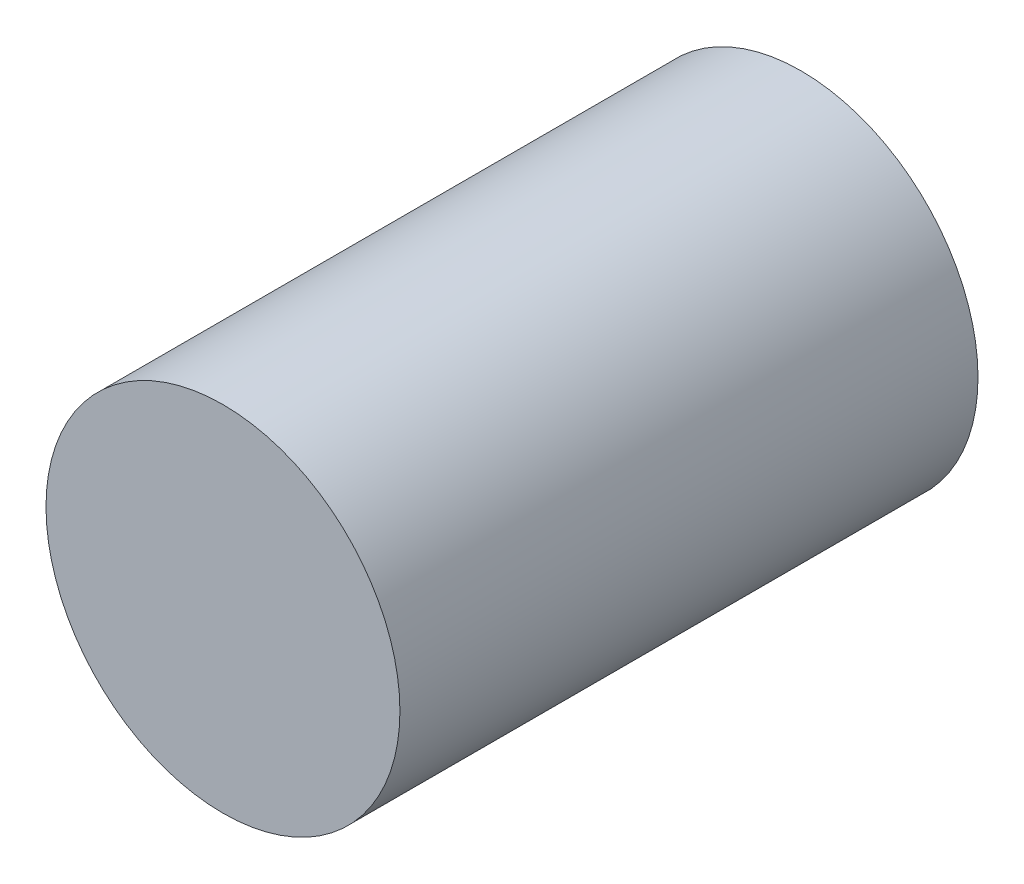
ISO-10303-21;
HEADER;
FILE_DESCRIPTION(('STEP AP214'),'2;1');
FILE_NAME('part.step','',(''),(''),'','','');
FILE_SCHEMA(('AUTOMOTIVE_DESIGN { 1 0 10303 214 1 1 1 1 }'));
ENDSEC;
DATA;
#1=APPLICATION_CONTEXT('core data for automotive mechanical design processes');
#2=APPLICATION_PROTOCOL_DEFINITION('international standard','automotive_design',2000,#1);
#3=PRODUCT_CONTEXT('',#1,'mechanical');
#4=PRODUCT('Part','Part','',(#3));
#5=PRODUCT_RELATED_PRODUCT_CATEGORY('part','',(#4));
#6=PRODUCT_DEFINITION_FORMATION('','',#4);
#7=PRODUCT_DEFINITION_CONTEXT('part definition',#1,'design');
#8=PRODUCT_DEFINITION('design','',#6,#7);
#9=PRODUCT_DEFINITION_SHAPE('','',#8);
#10=(LENGTH_UNIT() NAMED_UNIT(*) SI_UNIT(.MILLI.,.METRE.));
#11=(NAMED_UNIT(*) PLANE_ANGLE_UNIT() SI_UNIT($,.RADIAN.));
#12=(NAMED_UNIT(*) SI_UNIT($,.STERADIAN.) SOLID_ANGLE_UNIT());
#13=UNCERTAINTY_MEASURE_WITH_UNIT(LENGTH_MEASURE(1.E-05),#10,'distance_accuracy_value','');
#14=(GEOMETRIC_REPRESENTATION_CONTEXT(3) GLOBAL_UNCERTAINTY_ASSIGNED_CONTEXT((#13)) GLOBAL_UNIT_ASSIGNED_CONTEXT((#10,
#11,#12)) REPRESENTATION_CONTEXT('',''));
#15=CARTESIAN_POINT('',(0.,0.,0.));
#16=DIRECTION('',(0.,0.,1.));
#17=DIRECTION('',(1.,0.,0.));
#18=AXIS2_PLACEMENT_3D('',#15,#16,#17);
#19=CARTESIAN_POINT('',(0.,0.,9.8));
#20=DIRECTION('',(0.,0.,-1.));
#21=DIRECTION('',(-1.,0.,0.));
#22=AXIS2_PLACEMENT_3D('',#19,#20,#21);
#23=CYLINDRICAL_SURFACE('',#22,3.);
#24=CARTESIAN_POINT('',(0.,0.,9.8));
#25=DIRECTION('',(0.,0.,1.));
#26=DIRECTION('',(1.,0.,0.));
#27=AXIS2_PLACEMENT_3D('',#24,#25,#26);
#28=CIRCLE('',#27,3.);
#29=CARTESIAN_POINT('',(3.,0.,9.8));
#30=VERTEX_POINT('',#29);
#31=EDGE_CURVE('E10',#30,#30,#28,.T.);
#32=ORIENTED_EDGE('',*,*,#31,.F.);
#33=EDGE_LOOP('',(#32));
#34=FACE_BOUND('',#33,.T.);
#35=CARTESIAN_POINT('',(0.,0.,0.));
#36=DIRECTION('',(0.,0.,1.));
#37=DIRECTION('',(1.,0.,0.));
#38=AXIS2_PLACEMENT_3D('',#35,#36,#37);
#39=CIRCLE('',#38,3.);
#40=CARTESIAN_POINT('',(3.,0.,0.));
#41=VERTEX_POINT('',#40);
#42=EDGE_CURVE('E34',#41,#41,#39,.T.);
#43=ORIENTED_EDGE('',*,*,#42,.T.);
#44=EDGE_LOOP('',(#43));
#45=FACE_BOUND('',#44,.T.);
#46=ADVANCED_FACE('F31',(#34,#45),#23,.T.);
#47=CARTESIAN_POINT('',(0.,0.,9.8));
#48=DIRECTION('',(0.,0.,1.));
#49=DIRECTION('',(1.,0.,0.));
#50=AXIS2_PLACEMENT_3D('',#47,#48,#49);
#51=PLANE('',#50);
#52=ORIENTED_EDGE('',*,*,#31,.T.);
#53=EDGE_LOOP('',(#52));
#54=FACE_BOUND('',#53,.T.);
#55=ADVANCED_FACE('F46',(#54),#51,.T.);
#56=CARTESIAN_POINT('',(0.,0.,0.));
#57=DIRECTION('',(0.,0.,1.));
#58=DIRECTION('',(1.,0.,0.));
#59=AXIS2_PLACEMENT_3D('',#56,#57,#58);
#60=PLANE('',#59);
#61=ORIENTED_EDGE('',*,*,#42,.F.);
#62=EDGE_LOOP('',(#61));
#63=FACE_BOUND('',#62,.T.);
#64=ADVANCED_FACE('F44',(#63),#60,.F.);
#65=CLOSED_SHELL('',(#46,#55,#64));
#66=MANIFOLD_SOLID_BREP('B2',#65);
#67=ADVANCED_BREP_SHAPE_REPRESENTATION('',(#18,#66),#14);
#68=SHAPE_DEFINITION_REPRESENTATION(#9,#67);
ENDSEC;
END-ISO-10303-21;
